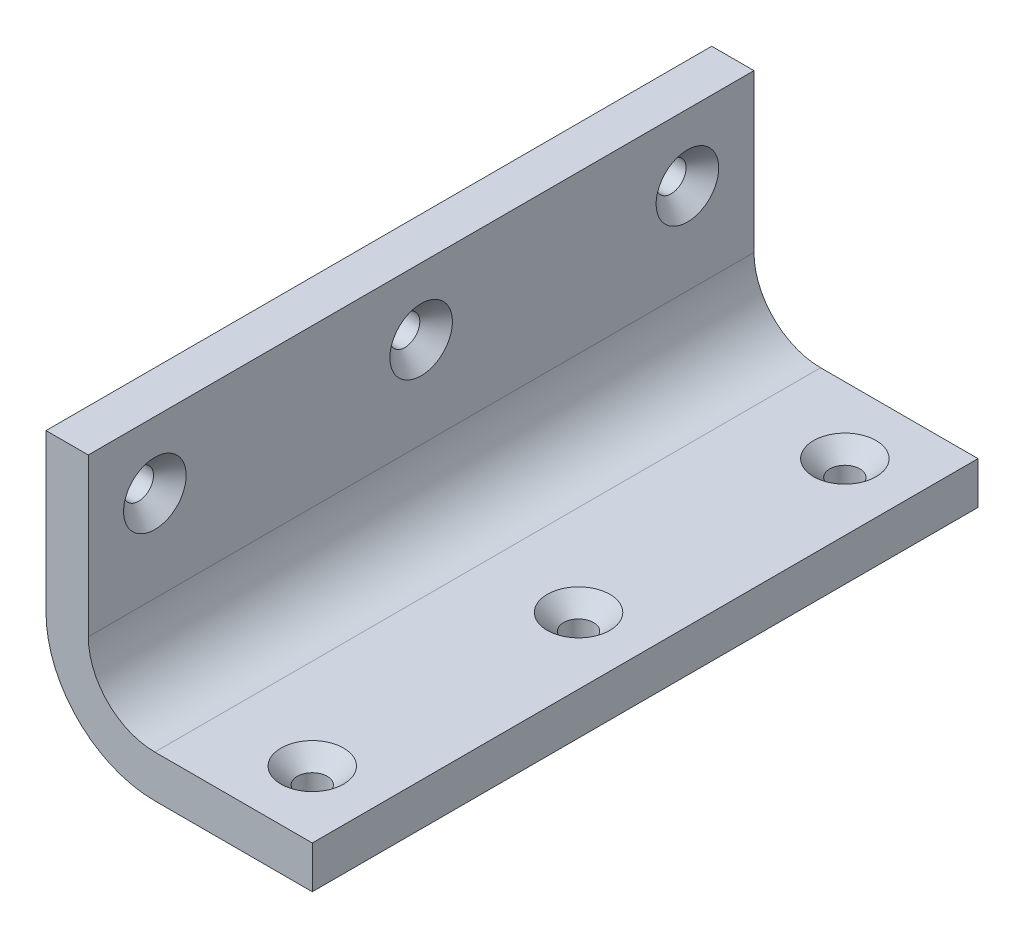
ISO-10303-21;
HEADER;
FILE_DESCRIPTION(('STEP AP214'),'2;1');
FILE_NAME('part.step','',(''),(''),'','','');
FILE_SCHEMA(('AUTOMOTIVE_DESIGN { 1 0 10303 214 1 1 1 1 }'));
ENDSEC;
DATA;
#1=APPLICATION_CONTEXT('core data for automotive mechanical design processes');
#2=APPLICATION_PROTOCOL_DEFINITION('international standard','automotive_design',2000,#1);
#3=PRODUCT_CONTEXT('',#1,'mechanical');
#4=PRODUCT('Part','Part','',(#3));
#5=PRODUCT_RELATED_PRODUCT_CATEGORY('part','',(#4));
#6=PRODUCT_DEFINITION_FORMATION('','',#4);
#7=PRODUCT_DEFINITION_CONTEXT('part definition',#1,'design');
#8=PRODUCT_DEFINITION('design','',#6,#7);
#9=PRODUCT_DEFINITION_SHAPE('','',#8);
#10=(LENGTH_UNIT() NAMED_UNIT(*) SI_UNIT(.MILLI.,.METRE.));
#11=(NAMED_UNIT(*) PLANE_ANGLE_UNIT() SI_UNIT($,.RADIAN.));
#12=(NAMED_UNIT(*) SI_UNIT($,.STERADIAN.) SOLID_ANGLE_UNIT());
#13=UNCERTAINTY_MEASURE_WITH_UNIT(LENGTH_MEASURE(1.E-05),#10,'distance_accuracy_value','');
#14=(GEOMETRIC_REPRESENTATION_CONTEXT(3) GLOBAL_UNCERTAINTY_ASSIGNED_CONTEXT((#13)) GLOBAL_UNIT_ASSIGNED_CONTEXT((#10,
#11,#12)) REPRESENTATION_CONTEXT('',''));
#15=CARTESIAN_POINT('',(0.,0.,0.));
#16=DIRECTION('',(0.,0.,1.));
#17=DIRECTION('',(1.,0.,0.));
#18=AXIS2_PLACEMENT_3D('',#15,#16,#17);
#19=CARTESIAN_POINT('',(6.35,40.,100.));
#20=DIRECTION('',(0.,-1.,0.));
#21=DIRECTION('',(1.,0.,0.));
#22=AXIS2_PLACEMENT_3D('',#19,#20,#21);
#23=PLANE('',#22);
#24=DIRECTION('',(-1.,0.,0.));
#25=VECTOR('',#24,1.);
#26=CARTESIAN_POINT('',(6.35,40.,0.));
#27=LINE('',#26,#25);
#28=CARTESIAN_POINT('',(6.35,40.,0.));
#29=VERTEX_POINT('',#28);
#30=CARTESIAN_POINT('',(0.,40.,0.));
#31=VERTEX_POINT('',#30);
#32=EDGE_CURVE('E129',#29,#31,#27,.T.);
#33=ORIENTED_EDGE('',*,*,#32,.T.);
#34=DIRECTION('',(0.,0.,-1.));
#35=VECTOR('',#34,1.);
#36=CARTESIAN_POINT('',(0.,40.,100.));
#37=LINE('',#36,#35);
#38=CARTESIAN_POINT('',(0.,40.,100.));
#39=VERTEX_POINT('',#38);
#40=EDGE_CURVE('E11',#39,#31,#37,.T.);
#41=ORIENTED_EDGE('',*,*,#40,.F.);
#42=DIRECTION('',(-1.,0.,0.));
#43=VECTOR('',#42,1.);
#44=CARTESIAN_POINT('',(6.35,40.,100.));
#45=LINE('',#44,#43);
#46=CARTESIAN_POINT('',(6.35,40.,100.));
#47=VERTEX_POINT('',#46);
#48=EDGE_CURVE('E144',#47,#39,#45,.T.);
#49=ORIENTED_EDGE('',*,*,#48,.F.);
#50=DIRECTION('',(0.,0.,-1.));
#51=VECTOR('',#50,1.);
#52=CARTESIAN_POINT('',(6.35,40.,100.));
#53=LINE('',#52,#51);
#54=EDGE_CURVE('E125',#47,#29,#53,.T.);
#55=ORIENTED_EDGE('',*,*,#54,.T.);
#56=EDGE_LOOP('',(#33,#41,#49,#55));
#57=FACE_BOUND('',#56,.T.);
#58=ADVANCED_FACE('F33',(#57),#23,.F.);
#59=CARTESIAN_POINT('',(0.,40.,100.));
#60=DIRECTION('',(1.,0.,0.));
#61=DIRECTION('',(0.,1.,0.));
#62=AXIS2_PLACEMENT_3D('',#59,#60,#61);
#63=PLANE('',#62);
#64=CARTESIAN_POINT('',(0.,30.,90.));
#65=DIRECTION('',(1.,0.,0.));
#66=DIRECTION('',(0.,0.,-1.));
#67=AXIS2_PLACEMENT_3D('',#64,#65,#66);
#68=CIRCLE('',#67,2.25);
#69=CARTESIAN_POINT('',(0.,30.,87.75));
#70=VERTEX_POINT('',#69);
#71=EDGE_CURVE('E221',#70,#70,#68,.T.);
#72=ORIENTED_EDGE('',*,*,#71,.T.);
#73=EDGE_LOOP('',(#72));
#74=FACE_BOUND('',#73,.T.);
#75=CARTESIAN_POINT('',(0.,30.,50.));
#76=DIRECTION('',(1.,0.,0.));
#77=DIRECTION('',(0.,0.,-1.));
#78=AXIS2_PLACEMENT_3D('',#75,#76,#77);
#79=CIRCLE('',#78,2.25);
#80=CARTESIAN_POINT('',(0.,30.,47.75));
#81=VERTEX_POINT('',#80);
#82=EDGE_CURVE('E212',#81,#81,#79,.T.);
#83=ORIENTED_EDGE('',*,*,#82,.T.);
#84=EDGE_LOOP('',(#83));
#85=FACE_BOUND('',#84,.T.);
#86=CARTESIAN_POINT('',(0.,30.,9.99999999999999));
#87=DIRECTION('',(1.,0.,0.));
#88=DIRECTION('',(0.,0.,-1.));
#89=AXIS2_PLACEMENT_3D('',#86,#87,#88);
#90=CIRCLE('',#89,2.25);
#91=CARTESIAN_POINT('',(0.,30.,7.75));
#92=VERTEX_POINT('',#91);
#93=EDGE_CURVE('E203',#92,#92,#90,.T.);
#94=ORIENTED_EDGE('',*,*,#93,.T.);
#95=EDGE_LOOP('',(#94));
#96=FACE_BOUND('',#95,.T.);
#97=DIRECTION('',(0.,-1.,0.));
#98=VECTOR('',#97,1.);
#99=CARTESIAN_POINT('',(0.,40.,0.));
#100=LINE('',#99,#98);
#101=CARTESIAN_POINT('',(0.,16.35,0.));
#102=VERTEX_POINT('',#101);
#103=EDGE_CURVE('E132',#31,#102,#100,.T.);
#104=ORIENTED_EDGE('',*,*,#103,.T.);
#105=DIRECTION('',(0.,0.,-1.));
#106=VECTOR('',#105,1.);
#107=CARTESIAN_POINT('',(0.,16.35,100.));
#108=LINE('',#107,#106);
#109=CARTESIAN_POINT('',(0.,16.35,100.));
#110=VERTEX_POINT('',#109);
#111=EDGE_CURVE('E41',#110,#102,#108,.T.);
#112=ORIENTED_EDGE('',*,*,#111,.F.);
#113=DIRECTION('',(0.,-1.,0.));
#114=VECTOR('',#113,1.);
#115=CARTESIAN_POINT('',(0.,40.,100.));
#116=LINE('',#115,#114);
#117=EDGE_CURVE('E92',#39,#110,#116,.T.);
#118=ORIENTED_EDGE('',*,*,#117,.F.);
#119=ORIENTED_EDGE('',*,*,#40,.T.);
#120=EDGE_LOOP('',(#104,#112,#118,#119));
#121=FACE_BOUND('',#120,.T.);
#122=ADVANCED_FACE('F259',(#74,#85,#96,#121),#63,.F.);
#123=CARTESIAN_POINT('',(16.35,16.35,100.));
#124=DIRECTION('',(0.,0.,-1.));
#125=DIRECTION('',(-1.,0.,0.));
#126=AXIS2_PLACEMENT_3D('',#123,#124,#125);
#127=CYLINDRICAL_SURFACE('',#126,16.35);
#128=CARTESIAN_POINT('',(16.35,16.35,0.));
#129=DIRECTION('',(0.,0.,1.));
#130=DIRECTION('',(1.,0.,0.));
#131=AXIS2_PLACEMENT_3D('',#128,#129,#130);
#132=CIRCLE('',#131,16.35);
#133=CARTESIAN_POINT('',(16.35,0.,0.));
#134=VERTEX_POINT('',#133);
#135=EDGE_CURVE('E135',#102,#134,#132,.T.);
#136=ORIENTED_EDGE('',*,*,#135,.T.);
#137=DIRECTION('',(0.,0.,-1.));
#138=VECTOR('',#137,1.);
#139=CARTESIAN_POINT('',(16.35,0.,100.));
#140=LINE('',#139,#138);
#141=CARTESIAN_POINT('',(16.35,0.,100.));
#142=VERTEX_POINT('',#141);
#143=EDGE_CURVE('E151',#142,#134,#140,.T.);
#144=ORIENTED_EDGE('',*,*,#143,.F.);
#145=CARTESIAN_POINT('',(16.35,16.35,100.));
#146=DIRECTION('',(0.,0.,1.));
#147=DIRECTION('',(1.,0.,0.));
#148=AXIS2_PLACEMENT_3D('',#145,#146,#147);
#149=CIRCLE('',#148,16.35);
#150=EDGE_CURVE('E159',#110,#142,#149,.T.);
#151=ORIENTED_EDGE('',*,*,#150,.F.);
#152=ORIENTED_EDGE('',*,*,#111,.T.);
#153=EDGE_LOOP('',(#136,#144,#151,#152));
#154=FACE_BOUND('',#153,.T.);
#155=ADVANCED_FACE('F157',(#154),#127,.T.);
#156=CARTESIAN_POINT('',(16.35,0.,100.));
#157=DIRECTION('',(0.,1.,0.));
#158=DIRECTION('',(-1.,0.,0.));
#159=AXIS2_PLACEMENT_3D('',#156,#157,#158);
#160=PLANE('',#159);
#161=CARTESIAN_POINT('',(30.,0.,90.));
#162=DIRECTION('',(0.,1.,0.));
#163=DIRECTION('',(0.,0.,1.));
#164=AXIS2_PLACEMENT_3D('',#161,#162,#163);
#165=CIRCLE('',#164,2.25);
#166=CARTESIAN_POINT('',(30.,0.,92.25));
#167=VERTEX_POINT('',#166);
#168=EDGE_CURVE('E194',#167,#167,#165,.T.);
#169=ORIENTED_EDGE('',*,*,#168,.T.);
#170=EDGE_LOOP('',(#169));
#171=FACE_BOUND('',#170,.T.);
#172=CARTESIAN_POINT('',(30.,0.,50.));
#173=DIRECTION('',(0.,1.,0.));
#174=DIRECTION('',(0.,0.,1.));
#175=AXIS2_PLACEMENT_3D('',#172,#173,#174);
#176=CIRCLE('',#175,2.25);
#177=CARTESIAN_POINT('',(30.,0.,52.25));
#178=VERTEX_POINT('',#177);
#179=EDGE_CURVE('E185',#178,#178,#176,.T.);
#180=ORIENTED_EDGE('',*,*,#179,.T.);
#181=EDGE_LOOP('',(#180));
#182=FACE_BOUND('',#181,.T.);
#183=CARTESIAN_POINT('',(30.,0.,10.));
#184=DIRECTION('',(0.,1.,0.));
#185=DIRECTION('',(0.,0.,1.));
#186=AXIS2_PLACEMENT_3D('',#183,#184,#185);
#187=CIRCLE('',#186,2.25);
#188=CARTESIAN_POINT('',(30.,0.,12.25));
#189=VERTEX_POINT('',#188);
#190=EDGE_CURVE('E133',#189,#189,#187,.T.);
#191=ORIENTED_EDGE('',*,*,#190,.T.);
#192=EDGE_LOOP('',(#191));
#193=FACE_BOUND('',#192,.T.);
#194=DIRECTION('',(1.,0.,0.));
#195=VECTOR('',#194,1.);
#196=CARTESIAN_POINT('',(16.35,0.,0.));
#197=LINE('',#196,#195);
#198=CARTESIAN_POINT('',(40.,0.,0.));
#199=VERTEX_POINT('',#198);
#200=EDGE_CURVE('E137',#134,#199,#197,.T.);
#201=ORIENTED_EDGE('',*,*,#200,.T.);
#202=DIRECTION('',(0.,0.,-1.));
#203=VECTOR('',#202,1.);
#204=CARTESIAN_POINT('',(40.,0.,100.));
#205=LINE('',#204,#203);
#206=CARTESIAN_POINT('',(40.,0.,100.));
#207=VERTEX_POINT('',#206);
#208=EDGE_CURVE('E148',#207,#199,#205,.T.);
#209=ORIENTED_EDGE('',*,*,#208,.F.);
#210=DIRECTION('',(1.,0.,0.));
#211=VECTOR('',#210,1.);
#212=CARTESIAN_POINT('',(16.35,0.,100.));
#213=LINE('',#212,#211);
#214=EDGE_CURVE('E171',#142,#207,#213,.T.);
#215=ORIENTED_EDGE('',*,*,#214,.F.);
#216=ORIENTED_EDGE('',*,*,#143,.T.);
#217=EDGE_LOOP('',(#201,#209,#215,#216));
#218=FACE_BOUND('',#217,.T.);
#219=ADVANCED_FACE('F167',(#171,#182,#193,#218),#160,.F.);
#220=CARTESIAN_POINT('',(40.,0.,100.));
#221=DIRECTION('',(-1.,0.,0.));
#222=DIRECTION('',(0.,-1.,0.));
#223=AXIS2_PLACEMENT_3D('',#220,#221,#222);
#224=PLANE('',#223);
#225=DIRECTION('',(0.,1.,0.));
#226=VECTOR('',#225,1.);
#227=CARTESIAN_POINT('',(40.,0.,0.));
#228=LINE('',#227,#226);
#229=CARTESIAN_POINT('',(40.,6.35,0.));
#230=VERTEX_POINT('',#229);
#231=EDGE_CURVE('E139',#199,#230,#228,.T.);
#232=ORIENTED_EDGE('',*,*,#231,.T.);
#233=DIRECTION('',(0.,0.,-1.));
#234=VECTOR('',#233,1.);
#235=CARTESIAN_POINT('',(40.,6.35,100.));
#236=LINE('',#235,#234);
#237=CARTESIAN_POINT('',(40.,6.35,100.));
#238=VERTEX_POINT('',#237);
#239=EDGE_CURVE('E120',#238,#230,#236,.T.);
#240=ORIENTED_EDGE('',*,*,#239,.F.);
#241=DIRECTION('',(0.,1.,0.));
#242=VECTOR('',#241,1.);
#243=CARTESIAN_POINT('',(40.,0.,100.));
#244=LINE('',#243,#242);
#245=EDGE_CURVE('E111',#207,#238,#244,.T.);
#246=ORIENTED_EDGE('',*,*,#245,.F.);
#247=ORIENTED_EDGE('',*,*,#208,.T.);
#248=EDGE_LOOP('',(#232,#240,#246,#247));
#249=FACE_BOUND('',#248,.T.);
#250=ADVANCED_FACE('F170',(#249),#224,.F.);
#251=CARTESIAN_POINT('',(40.,6.35,100.));
#252=DIRECTION('',(0.,-1.,0.));
#253=DIRECTION('',(0.,0.,-1.));
#254=AXIS2_PLACEMENT_3D('',#251,#252,#253);
#255=PLANE('',#254);
#256=CARTESIAN_POINT('',(30.,6.35,90.));
#257=DIRECTION('',(0.,1.,0.));
#258=DIRECTION('',(0.,0.,1.));
#259=AXIS2_PLACEMENT_3D('',#256,#257,#258);
#260=CIRCLE('',#259,4.7);
#261=CARTESIAN_POINT('',(30.,6.35,94.7));
#262=VERTEX_POINT('',#261);
#263=EDGE_CURVE('E200',#262,#262,#260,.T.);
#264=ORIENTED_EDGE('',*,*,#263,.F.);
#265=EDGE_LOOP('',(#264));
#266=FACE_BOUND('',#265,.T.);
#267=CARTESIAN_POINT('',(30.,6.35,50.));
#268=DIRECTION('',(0.,1.,0.));
#269=DIRECTION('',(0.,0.,1.));
#270=AXIS2_PLACEMENT_3D('',#267,#268,#269);
#271=CIRCLE('',#270,4.7);
#272=CARTESIAN_POINT('',(30.,6.35,54.7));
#273=VERTEX_POINT('',#272);
#274=EDGE_CURVE('E191',#273,#273,#271,.T.);
#275=ORIENTED_EDGE('',*,*,#274,.F.);
#276=EDGE_LOOP('',(#275));
#277=FACE_BOUND('',#276,.T.);
#278=CARTESIAN_POINT('',(30.,6.35,10.));
#279=DIRECTION('',(0.,1.,0.));
#280=DIRECTION('',(0.,0.,1.));
#281=AXIS2_PLACEMENT_3D('',#278,#279,#280);
#282=CIRCLE('',#281,4.7);
#283=CARTESIAN_POINT('',(30.,6.35,14.7));
#284=VERTEX_POINT('',#283);
#285=EDGE_CURVE('E182',#284,#284,#282,.T.);
#286=ORIENTED_EDGE('',*,*,#285,.F.);
#287=EDGE_LOOP('',(#286));
#288=FACE_BOUND('',#287,.T.);
#289=DIRECTION('',(-1.,0.,0.));
#290=VECTOR('',#289,1.);
#291=CARTESIAN_POINT('',(40.,6.35,0.));
#292=LINE('',#291,#290);
#293=CARTESIAN_POINT('',(16.35,6.35,0.));
#294=VERTEX_POINT('',#293);
#295=EDGE_CURVE('E119',#230,#294,#292,.T.);
#296=ORIENTED_EDGE('',*,*,#295,.T.);
#297=DIRECTION('',(0.,0.,-1.));
#298=VECTOR('',#297,1.);
#299=CARTESIAN_POINT('',(16.35,6.35,100.));
#300=LINE('',#299,#298);
#301=CARTESIAN_POINT('',(16.35,6.35,100.));
#302=VERTEX_POINT('',#301);
#303=EDGE_CURVE('E116',#302,#294,#300,.T.);
#304=ORIENTED_EDGE('',*,*,#303,.F.);
#305=DIRECTION('',(-1.,0.,0.));
#306=VECTOR('',#305,1.);
#307=CARTESIAN_POINT('',(40.,6.35,100.));
#308=LINE('',#307,#306);
#309=EDGE_CURVE('E105',#238,#302,#308,.T.);
#310=ORIENTED_EDGE('',*,*,#309,.F.);
#311=ORIENTED_EDGE('',*,*,#239,.T.);
#312=EDGE_LOOP('',(#296,#304,#310,#311));
#313=FACE_BOUND('',#312,.T.);
#314=ADVANCED_FACE('F117',(#266,#277,#288,#313),#255,.F.);
#315=CARTESIAN_POINT('',(16.35,16.35,100.));
#316=DIRECTION('',(0.,0.,-1.));
#317=DIRECTION('',(-1.,0.,0.));
#318=AXIS2_PLACEMENT_3D('',#315,#316,#317);
#319=CYLINDRICAL_SURFACE('',#318,10.);
#320=CARTESIAN_POINT('',(16.35,16.35,0.));
#321=DIRECTION('',(0.,0.,-1.));
#322=DIRECTION('',(1.,0.,0.));
#323=AXIS2_PLACEMENT_3D('',#320,#321,#322);
#324=CIRCLE('',#323,10.);
#325=CARTESIAN_POINT('',(6.35,16.35,0.));
#326=VERTEX_POINT('',#325);
#327=EDGE_CURVE('E78',#294,#326,#324,.T.);
#328=ORIENTED_EDGE('',*,*,#327,.T.);
#329=DIRECTION('',(0.,0.,-1.));
#330=VECTOR('',#329,1.);
#331=CARTESIAN_POINT('',(6.35,16.35,100.));
#332=LINE('',#331,#330);
#333=CARTESIAN_POINT('',(6.35,16.35,100.));
#334=VERTEX_POINT('',#333);
#335=EDGE_CURVE('E121',#334,#326,#332,.T.);
#336=ORIENTED_EDGE('',*,*,#335,.F.);
#337=CARTESIAN_POINT('',(16.35,16.35,100.));
#338=DIRECTION('',(0.,0.,-1.));
#339=DIRECTION('',(1.,0.,0.));
#340=AXIS2_PLACEMENT_3D('',#337,#338,#339);
#341=CIRCLE('',#340,10.);
#342=EDGE_CURVE('E109',#302,#334,#341,.T.);
#343=ORIENTED_EDGE('',*,*,#342,.F.);
#344=ORIENTED_EDGE('',*,*,#303,.T.);
#345=EDGE_LOOP('',(#328,#336,#343,#344));
#346=FACE_BOUND('',#345,.T.);
#347=ADVANCED_FACE('F123',(#346),#319,.F.);
#348=CARTESIAN_POINT('',(6.35,16.35,100.));
#349=DIRECTION('',(-1.,0.,0.));
#350=DIRECTION('',(0.,-1.,0.));
#351=AXIS2_PLACEMENT_3D('',#348,#349,#350);
#352=PLANE('',#351);
#353=CARTESIAN_POINT('',(6.35000000000001,30.,90.));
#354=DIRECTION('',(1.,0.,0.));
#355=DIRECTION('',(0.,0.,-1.));
#356=AXIS2_PLACEMENT_3D('',#353,#354,#355);
#357=CIRCLE('',#356,4.7);
#358=CARTESIAN_POINT('',(6.35000000000001,30.,85.3));
#359=VERTEX_POINT('',#358);
#360=EDGE_CURVE('E227',#359,#359,#357,.T.);
#361=ORIENTED_EDGE('',*,*,#360,.F.);
#362=EDGE_LOOP('',(#361));
#363=FACE_BOUND('',#362,.T.);
#364=CARTESIAN_POINT('',(6.35000000000001,30.,50.));
#365=DIRECTION('',(1.,0.,0.));
#366=DIRECTION('',(0.,0.,-1.));
#367=AXIS2_PLACEMENT_3D('',#364,#365,#366);
#368=CIRCLE('',#367,4.7);
#369=CARTESIAN_POINT('',(6.35000000000001,30.,45.3));
#370=VERTEX_POINT('',#369);
#371=EDGE_CURVE('E218',#370,#370,#368,.T.);
#372=ORIENTED_EDGE('',*,*,#371,.F.);
#373=EDGE_LOOP('',(#372));
#374=FACE_BOUND('',#373,.T.);
#375=CARTESIAN_POINT('',(6.35000000000001,30.,9.99999999999999));
#376=DIRECTION('',(1.,0.,0.));
#377=DIRECTION('',(0.,0.,-1.));
#378=AXIS2_PLACEMENT_3D('',#375,#376,#377);
#379=CIRCLE('',#378,4.7);
#380=CARTESIAN_POINT('',(6.35000000000001,30.,5.3));
#381=VERTEX_POINT('',#380);
#382=EDGE_CURVE('E209',#381,#381,#379,.T.);
#383=ORIENTED_EDGE('',*,*,#382,.F.);
#384=EDGE_LOOP('',(#383));
#385=FACE_BOUND('',#384,.T.);
#386=DIRECTION('',(0.,1.,0.));
#387=VECTOR('',#386,1.);
#388=CARTESIAN_POINT('',(6.35,16.35,0.));
#389=LINE('',#388,#387);
#390=EDGE_CURVE('E84',#326,#29,#389,.T.);
#391=ORIENTED_EDGE('',*,*,#390,.T.);
#392=ORIENTED_EDGE('',*,*,#54,.F.);
#393=DIRECTION('',(0.,1.,0.));
#394=VECTOR('',#393,1.);
#395=CARTESIAN_POINT('',(6.35,16.35,100.));
#396=LINE('',#395,#394);
#397=EDGE_CURVE('E49',#334,#47,#396,.T.);
#398=ORIENTED_EDGE('',*,*,#397,.F.);
#399=ORIENTED_EDGE('',*,*,#335,.T.);
#400=EDGE_LOOP('',(#391,#392,#398,#399));
#401=FACE_BOUND('',#400,.T.);
#402=ADVANCED_FACE('F233',(#363,#374,#385,#401),#352,.F.);
#403=CARTESIAN_POINT('',(16.35,16.35,100.));
#404=DIRECTION('',(0.,0.,1.));
#405=DIRECTION('',(1.,0.,0.));
#406=AXIS2_PLACEMENT_3D('',#403,#404,#405);
#407=PLANE('',#406);
#408=ORIENTED_EDGE('',*,*,#48,.T.);
#409=ORIENTED_EDGE('',*,*,#117,.T.);
#410=ORIENTED_EDGE('',*,*,#150,.T.);
#411=ORIENTED_EDGE('',*,*,#214,.T.);
#412=ORIENTED_EDGE('',*,*,#245,.T.);
#413=ORIENTED_EDGE('',*,*,#309,.T.);
#414=ORIENTED_EDGE('',*,*,#342,.T.);
#415=ORIENTED_EDGE('',*,*,#397,.T.);
#416=EDGE_LOOP('',(#408,#409,#410,#411,#412,#413,#414,#415));
#417=FACE_BOUND('',#416,.T.);
#418=ADVANCED_FACE('F107',(#417),#407,.T.);
#419=CARTESIAN_POINT('',(16.35,16.35,0.));
#420=DIRECTION('',(0.,0.,1.));
#421=DIRECTION('',(1.,0.,0.));
#422=AXIS2_PLACEMENT_3D('',#419,#420,#421);
#423=PLANE('',#422);
#424=ORIENTED_EDGE('',*,*,#32,.F.);
#425=ORIENTED_EDGE('',*,*,#390,.F.);
#426=ORIENTED_EDGE('',*,*,#327,.F.);
#427=ORIENTED_EDGE('',*,*,#295,.F.);
#428=ORIENTED_EDGE('',*,*,#231,.F.);
#429=ORIENTED_EDGE('',*,*,#200,.F.);
#430=ORIENTED_EDGE('',*,*,#135,.F.);
#431=ORIENTED_EDGE('',*,*,#103,.F.);
#432=EDGE_LOOP('',(#424,#425,#426,#427,#428,#429,#430,#431));
#433=FACE_BOUND('',#432,.T.);
#434=ADVANCED_FACE('F163',(#433),#423,.F.);
#435=CARTESIAN_POINT('',(30.,6.35,10.));
#436=DIRECTION('',(0.,1.,0.));
#437=DIRECTION('',(0.,0.,1.));
#438=AXIS2_PLACEMENT_3D('',#435,#436,#437);
#439=CYLINDRICAL_SURFACE('',#438,2.25);
#440=ORIENTED_EDGE('',*,*,#190,.F.);
#441=EDGE_LOOP('',(#440));
#442=FACE_BOUND('',#441,.T.);
#443=CARTESIAN_POINT('',(30.,3.9,10.));
#444=DIRECTION('',(0.,1.,0.));
#445=DIRECTION('',(0.,0.,1.));
#446=AXIS2_PLACEMENT_3D('',#443,#444,#445);
#447=CIRCLE('',#446,2.25);
#448=CARTESIAN_POINT('',(30.,3.9,12.25));
#449=VERTEX_POINT('',#448);
#450=EDGE_CURVE('E179',#449,#449,#447,.T.);
#451=ORIENTED_EDGE('',*,*,#450,.T.);
#452=EDGE_LOOP('',(#451));
#453=FACE_BOUND('',#452,.T.);
#454=ADVANCED_FACE('F285',(#442,#453),#439,.F.);
#455=CARTESIAN_POINT('',(30.,6.35,10.));
#456=DIRECTION('',(0.,1.,0.));
#457=DIRECTION('',(0.,0.,1.));
#458=AXIS2_PLACEMENT_3D('',#455,#456,#457);
#459=CONICAL_SURFACE('',#458,4.7,0.785398163397449);
#460=ORIENTED_EDGE('',*,*,#450,.F.);
#461=EDGE_LOOP('',(#460));
#462=FACE_BOUND('',#461,.T.);
#463=ORIENTED_EDGE('',*,*,#285,.T.);
#464=EDGE_LOOP('',(#463));
#465=FACE_BOUND('',#464,.T.);
#466=ADVANCED_FACE('F290',(#462,#465),#459,.F.);
#467=CARTESIAN_POINT('',(30.,6.35,50.));
#468=DIRECTION('',(0.,1.,0.));
#469=DIRECTION('',(0.,0.,1.));
#470=AXIS2_PLACEMENT_3D('',#467,#468,#469);
#471=CYLINDRICAL_SURFACE('',#470,2.25);
#472=ORIENTED_EDGE('',*,*,#179,.F.);
#473=EDGE_LOOP('',(#472));
#474=FACE_BOUND('',#473,.T.);
#475=CARTESIAN_POINT('',(30.,3.9,50.));
#476=DIRECTION('',(0.,1.,0.));
#477=DIRECTION('',(0.,0.,1.));
#478=AXIS2_PLACEMENT_3D('',#475,#476,#477);
#479=CIRCLE('',#478,2.25);
#480=CARTESIAN_POINT('',(30.,3.9,52.25));
#481=VERTEX_POINT('',#480);
#482=EDGE_CURVE('E188',#481,#481,#479,.T.);
#483=ORIENTED_EDGE('',*,*,#482,.T.);
#484=EDGE_LOOP('',(#483));
#485=FACE_BOUND('',#484,.T.);
#486=ADVANCED_FACE('F294',(#474,#485),#471,.F.);
#487=CARTESIAN_POINT('',(30.,6.35,50.));
#488=DIRECTION('',(0.,1.,0.));
#489=DIRECTION('',(0.,0.,1.));
#490=AXIS2_PLACEMENT_3D('',#487,#488,#489);
#491=CONICAL_SURFACE('',#490,4.7,0.785398163397449);
#492=ORIENTED_EDGE('',*,*,#482,.F.);
#493=EDGE_LOOP('',(#492));
#494=FACE_BOUND('',#493,.T.);
#495=ORIENTED_EDGE('',*,*,#274,.T.);
#496=EDGE_LOOP('',(#495));
#497=FACE_BOUND('',#496,.T.);
#498=ADVANCED_FACE('F298',(#494,#497),#491,.F.);
#499=CARTESIAN_POINT('',(30.,6.35,90.));
#500=DIRECTION('',(0.,1.,0.));
#501=DIRECTION('',(0.,0.,1.));
#502=AXIS2_PLACEMENT_3D('',#499,#500,#501);
#503=CYLINDRICAL_SURFACE('',#502,2.25);
#504=ORIENTED_EDGE('',*,*,#168,.F.);
#505=EDGE_LOOP('',(#504));
#506=FACE_BOUND('',#505,.T.);
#507=CARTESIAN_POINT('',(30.,3.9,90.));
#508=DIRECTION('',(0.,1.,0.));
#509=DIRECTION('',(0.,0.,1.));
#510=AXIS2_PLACEMENT_3D('',#507,#508,#509);
#511=CIRCLE('',#510,2.25);
#512=CARTESIAN_POINT('',(30.,3.9,92.25));
#513=VERTEX_POINT('',#512);
#514=EDGE_CURVE('E197',#513,#513,#511,.T.);
#515=ORIENTED_EDGE('',*,*,#514,.T.);
#516=EDGE_LOOP('',(#515));
#517=FACE_BOUND('',#516,.T.);
#518=ADVANCED_FACE('F302',(#506,#517),#503,.F.);
#519=CARTESIAN_POINT('',(30.,6.35,90.));
#520=DIRECTION('',(0.,1.,0.));
#521=DIRECTION('',(0.,0.,1.));
#522=AXIS2_PLACEMENT_3D('',#519,#520,#521);
#523=CONICAL_SURFACE('',#522,4.7,0.785398163397449);
#524=ORIENTED_EDGE('',*,*,#514,.F.);
#525=EDGE_LOOP('',(#524));
#526=FACE_BOUND('',#525,.T.);
#527=ORIENTED_EDGE('',*,*,#263,.T.);
#528=EDGE_LOOP('',(#527));
#529=FACE_BOUND('',#528,.T.);
#530=ADVANCED_FACE('F254',(#526,#529),#523,.F.);
#531=CARTESIAN_POINT('',(6.35000000000001,30.,9.99999999999999));
#532=DIRECTION('',(1.,0.,0.));
#533=DIRECTION('',(0.,0.,-1.));
#534=AXIS2_PLACEMENT_3D('',#531,#532,#533);
#535=CYLINDRICAL_SURFACE('',#534,2.25);
#536=ORIENTED_EDGE('',*,*,#93,.F.);
#537=EDGE_LOOP('',(#536));
#538=FACE_BOUND('',#537,.T.);
#539=CARTESIAN_POINT('',(3.90000000000001,30.,9.99999999999999));
#540=DIRECTION('',(1.,0.,0.));
#541=DIRECTION('',(0.,0.,-1.));
#542=AXIS2_PLACEMENT_3D('',#539,#540,#541);
#543=CIRCLE('',#542,2.25);
#544=CARTESIAN_POINT('',(3.90000000000001,30.,7.75));
#545=VERTEX_POINT('',#544);
#546=EDGE_CURVE('E206',#545,#545,#543,.T.);
#547=ORIENTED_EDGE('',*,*,#546,.T.);
#548=EDGE_LOOP('',(#547));
#549=FACE_BOUND('',#548,.T.);
#550=ADVANCED_FACE('F244',(#538,#549),#535,.F.);
#551=CARTESIAN_POINT('',(6.35000000000001,30.,9.99999999999999));
#552=DIRECTION('',(1.,0.,0.));
#553=DIRECTION('',(0.,0.,-1.));
#554=AXIS2_PLACEMENT_3D('',#551,#552,#553);
#555=CONICAL_SURFACE('',#554,4.7,0.785398163397449);
#556=ORIENTED_EDGE('',*,*,#546,.F.);
#557=EDGE_LOOP('',(#556));
#558=FACE_BOUND('',#557,.T.);
#559=ORIENTED_EDGE('',*,*,#382,.T.);
#560=EDGE_LOOP('',(#559));
#561=FACE_BOUND('',#560,.T.);
#562=ADVANCED_FACE('F241',(#558,#561),#555,.F.);
#563=CARTESIAN_POINT('',(6.35000000000001,30.,50.));
#564=DIRECTION('',(1.,0.,0.));
#565=DIRECTION('',(0.,0.,-1.));
#566=AXIS2_PLACEMENT_3D('',#563,#564,#565);
#567=CYLINDRICAL_SURFACE('',#566,2.25);
#568=ORIENTED_EDGE('',*,*,#82,.F.);
#569=EDGE_LOOP('',(#568));
#570=FACE_BOUND('',#569,.T.);
#571=CARTESIAN_POINT('',(3.90000000000001,30.,50.));
#572=DIRECTION('',(1.,0.,0.));
#573=DIRECTION('',(0.,0.,-1.));
#574=AXIS2_PLACEMENT_3D('',#571,#572,#573);
#575=CIRCLE('',#574,2.25);
#576=CARTESIAN_POINT('',(3.90000000000001,30.,47.75));
#577=VERTEX_POINT('',#576);
#578=EDGE_CURVE('E215',#577,#577,#575,.T.);
#579=ORIENTED_EDGE('',*,*,#578,.T.);
#580=EDGE_LOOP('',(#579));
#581=FACE_BOUND('',#580,.T.);
#582=ADVANCED_FACE('F243',(#570,#581),#567,.F.);
#583=CARTESIAN_POINT('',(6.35000000000001,30.,50.));
#584=DIRECTION('',(1.,0.,0.));
#585=DIRECTION('',(0.,0.,-1.));
#586=AXIS2_PLACEMENT_3D('',#583,#584,#585);
#587=CONICAL_SURFACE('',#586,4.7,0.785398163397449);
#588=ORIENTED_EDGE('',*,*,#578,.F.);
#589=EDGE_LOOP('',(#588));
#590=FACE_BOUND('',#589,.T.);
#591=ORIENTED_EDGE('',*,*,#371,.T.);
#592=EDGE_LOOP('',(#591));
#593=FACE_BOUND('',#592,.T.);
#594=ADVANCED_FACE('F251',(#590,#593),#587,.F.);
#595=CARTESIAN_POINT('',(6.35000000000001,30.,90.));
#596=DIRECTION('',(1.,0.,0.));
#597=DIRECTION('',(0.,0.,-1.));
#598=AXIS2_PLACEMENT_3D('',#595,#596,#597);
#599=CYLINDRICAL_SURFACE('',#598,2.25);
#600=ORIENTED_EDGE('',*,*,#71,.F.);
#601=EDGE_LOOP('',(#600));
#602=FACE_BOUND('',#601,.T.);
#603=CARTESIAN_POINT('',(3.90000000000001,30.,90.));
#604=DIRECTION('',(1.,0.,0.));
#605=DIRECTION('',(0.,0.,-1.));
#606=AXIS2_PLACEMENT_3D('',#603,#604,#605);
#607=CIRCLE('',#606,2.25);
#608=CARTESIAN_POINT('',(3.90000000000001,30.,87.75));
#609=VERTEX_POINT('',#608);
#610=EDGE_CURVE('E224',#609,#609,#607,.T.);
#611=ORIENTED_EDGE('',*,*,#610,.T.);
#612=EDGE_LOOP('',(#611));
#613=FACE_BOUND('',#612,.T.);
#614=ADVANCED_FACE('F349',(#602,#613),#599,.F.);
#615=CARTESIAN_POINT('',(6.35000000000001,30.,90.));
#616=DIRECTION('',(1.,0.,0.));
#617=DIRECTION('',(0.,0.,-1.));
#618=AXIS2_PLACEMENT_3D('',#615,#616,#617);
#619=CONICAL_SURFACE('',#618,4.7,0.785398163397449);
#620=ORIENTED_EDGE('',*,*,#610,.F.);
#621=EDGE_LOOP('',(#620));
#622=FACE_BOUND('',#621,.T.);
#623=ORIENTED_EDGE('',*,*,#360,.T.);
#624=EDGE_LOOP('',(#623));
#625=FACE_BOUND('',#624,.T.);
#626=ADVANCED_FACE('F231',(#622,#625),#619,.F.);
#627=CLOSED_SHELL('',(#58,#122,#155,#219,#250,#314,#347,#402,#418,#434,#454,#466,#486,#498,#518,
#530,#550,#562,#582,#594,#614,#626));
#628=MANIFOLD_SOLID_BREP('B2',#627);
#629=ADVANCED_BREP_SHAPE_REPRESENTATION('',(#18,#628),#14);
#630=SHAPE_DEFINITION_REPRESENTATION(#9,#629);
ENDSEC;
END-ISO-10303-21;
